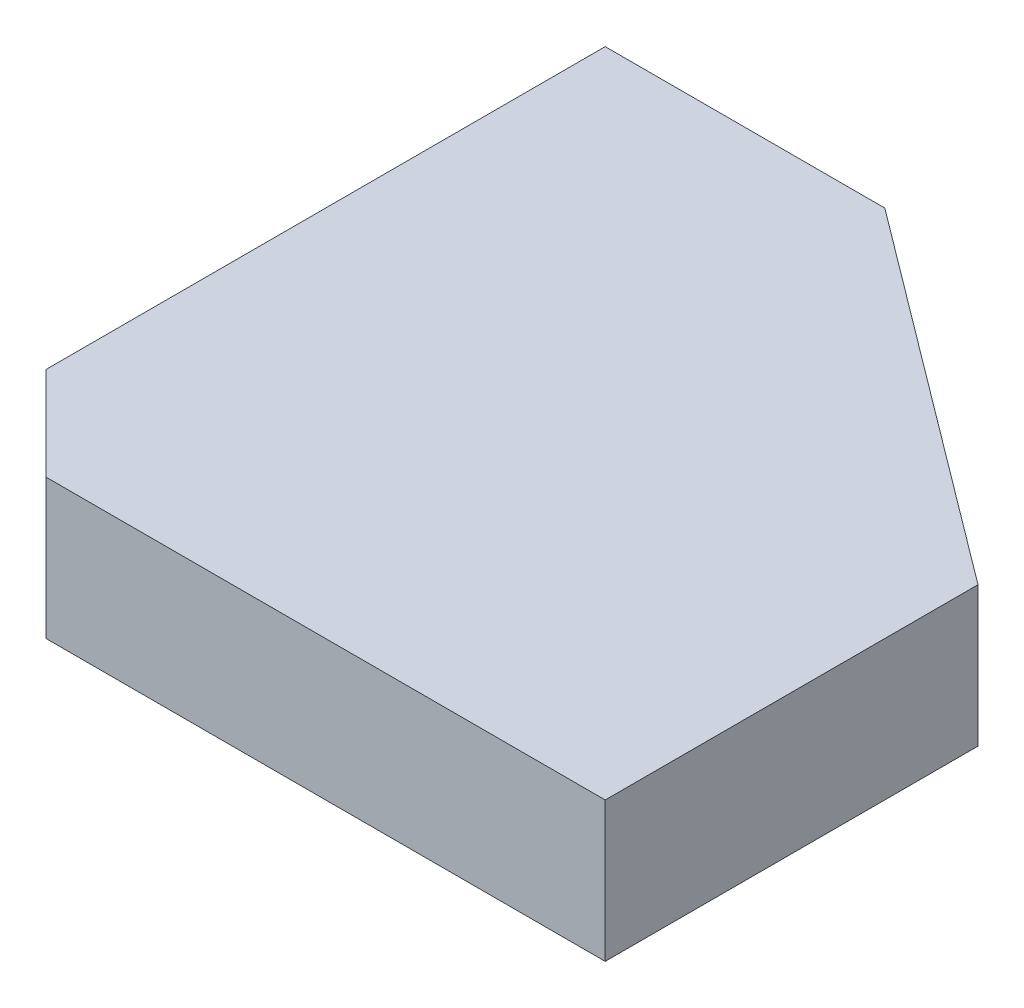
ISO-10303-21;
HEADER;
FILE_DESCRIPTION(('STEP AP214'),'2;1');
FILE_NAME('part.step','',(''),(''),'','','');
FILE_SCHEMA(('AUTOMOTIVE_DESIGN { 1 0 10303 214 1 1 1 1 }'));
ENDSEC;
DATA;
#1=APPLICATION_CONTEXT('core data for automotive mechanical design processes');
#2=APPLICATION_PROTOCOL_DEFINITION('international standard','automotive_design',2000,#1);
#3=PRODUCT_CONTEXT('',#1,'mechanical');
#4=PRODUCT('Part','Part','',(#3));
#5=PRODUCT_RELATED_PRODUCT_CATEGORY('part','',(#4));
#6=PRODUCT_DEFINITION_FORMATION('','',#4);
#7=PRODUCT_DEFINITION_CONTEXT('part definition',#1,'design');
#8=PRODUCT_DEFINITION('design','',#6,#7);
#9=PRODUCT_DEFINITION_SHAPE('','',#8);
#10=(LENGTH_UNIT() NAMED_UNIT(*) SI_UNIT(.MILLI.,.METRE.));
#11=(NAMED_UNIT(*) PLANE_ANGLE_UNIT() SI_UNIT($,.RADIAN.));
#12=(NAMED_UNIT(*) SI_UNIT($,.STERADIAN.) SOLID_ANGLE_UNIT());
#13=UNCERTAINTY_MEASURE_WITH_UNIT(LENGTH_MEASURE(1.E-05),#10,'distance_accuracy_value','');
#14=(GEOMETRIC_REPRESENTATION_CONTEXT(3) GLOBAL_UNCERTAINTY_ASSIGNED_CONTEXT((#13)) GLOBAL_UNIT_ASSIGNED_CONTEXT((#10,
#11,#12)) REPRESENTATION_CONTEXT('',''));
#15=CARTESIAN_POINT('',(0.,0.,0.));
#16=DIRECTION('',(0.,0.,1.));
#17=DIRECTION('',(1.,0.,0.));
#18=AXIS2_PLACEMENT_3D('',#15,#16,#17);
#19=CARTESIAN_POINT('',(0.,4.7625,0.));
#20=DIRECTION('',(-1.,0.,0.));
#21=DIRECTION('',(0.,0.,1.));
#22=AXIS2_PLACEMENT_3D('',#19,#20,#21);
#23=PLANE('',#22);
#24=DIRECTION('',(0.,0.,-1.));
#25=VECTOR('',#24,1.);
#26=CARTESIAN_POINT('',(0.,-4.7625,0.));
#27=LINE('',#26,#25);
#28=CARTESIAN_POINT('',(0.,-4.7625,-6.35000000000004));
#29=VERTEX_POINT('',#28);
#30=CARTESIAN_POINT('',(0.,-4.7625,-44.45));
#31=VERTEX_POINT('',#30);
#32=EDGE_CURVE('E137',#29,#31,#27,.T.);
#33=ORIENTED_EDGE('',*,*,#32,.F.);
#34=DIRECTION('',(0.,1.,0.));
#35=VECTOR('',#34,1.);
#36=CARTESIAN_POINT('',(0.,4.7625,-6.35000000000004));
#37=LINE('',#36,#35);
#38=CARTESIAN_POINT('',(0.,4.7625,-6.35000000000004));
#39=VERTEX_POINT('',#38);
#40=EDGE_CURVE('E42',#29,#39,#37,.T.);
#41=ORIENTED_EDGE('',*,*,#40,.T.);
#42=DIRECTION('',(0.,0.,-1.));
#43=VECTOR('',#42,1.);
#44=CARTESIAN_POINT('',(0.,4.7625,0.));
#45=LINE('',#44,#43);
#46=CARTESIAN_POINT('',(0.,4.7625,-44.45));
#47=VERTEX_POINT('',#46);
#48=EDGE_CURVE('E83',#39,#47,#45,.T.);
#49=ORIENTED_EDGE('',*,*,#48,.T.);
#50=DIRECTION('',(0.,-1.,0.));
#51=VECTOR('',#50,1.);
#52=CARTESIAN_POINT('',(0.,4.7625,-44.45));
#53=LINE('',#52,#51);
#54=EDGE_CURVE('E86',#47,#31,#53,.T.);
#55=ORIENTED_EDGE('',*,*,#54,.T.);
#56=EDGE_LOOP('',(#33,#41,#49,#55));
#57=FACE_BOUND('',#56,.T.);
#58=ADVANCED_FACE('F34',(#57),#23,.T.);
#59=CARTESIAN_POINT('',(0.,4.7625,0.));
#60=DIRECTION('',(0.,0.,-1.));
#61=DIRECTION('',(-1.,0.,0.));
#62=AXIS2_PLACEMENT_3D('',#59,#60,#61);
#63=PLANE('',#62);
#64=DIRECTION('',(1.,0.,0.));
#65=VECTOR('',#64,1.);
#66=CARTESIAN_POINT('',(0.,4.7625,0.));
#67=LINE('',#66,#65);
#68=CARTESIAN_POINT('',(6.35000000000011,4.7625,0.));
#69=VERTEX_POINT('',#68);
#70=CARTESIAN_POINT('',(44.45,4.7625,0.));
#71=VERTEX_POINT('',#70);
#72=EDGE_CURVE('E106',#69,#71,#67,.T.);
#73=ORIENTED_EDGE('',*,*,#72,.F.);
#74=DIRECTION('',(0.,-1.,0.));
#75=VECTOR('',#74,1.);
#76=CARTESIAN_POINT('',(6.35000000000011,-4.7625,0.));
#77=LINE('',#76,#75);
#78=CARTESIAN_POINT('',(6.35000000000011,-4.7625,0.));
#79=VERTEX_POINT('',#78);
#80=EDGE_CURVE('E114',#69,#79,#77,.T.);
#81=ORIENTED_EDGE('',*,*,#80,.T.);
#82=DIRECTION('',(1.,0.,0.));
#83=VECTOR('',#82,1.);
#84=CARTESIAN_POINT('',(0.,-4.7625,0.));
#85=LINE('',#84,#83);
#86=CARTESIAN_POINT('',(44.45,-4.7625,0.));
#87=VERTEX_POINT('',#86);
#88=EDGE_CURVE('E92',#79,#87,#85,.T.);
#89=ORIENTED_EDGE('',*,*,#88,.T.);
#90=DIRECTION('',(0.,-1.,0.));
#91=VECTOR('',#90,1.);
#92=CARTESIAN_POINT('',(44.45,4.7625,0.));
#93=LINE('',#92,#91);
#94=EDGE_CURVE('E117',#71,#87,#93,.T.);
#95=ORIENTED_EDGE('',*,*,#94,.F.);
#96=EDGE_LOOP('',(#73,#81,#89,#95));
#97=FACE_BOUND('',#96,.T.);
#98=ADVANCED_FACE('F145',(#97),#63,.F.);
#99=CARTESIAN_POINT('',(44.45,4.7625,-25.4));
#100=DIRECTION('',(1.,0.,0.));
#101=DIRECTION('',(0.,0.,-1.));
#102=AXIS2_PLACEMENT_3D('',#99,#100,#101);
#103=PLANE('',#102);
#104=DIRECTION('',(0.,0.,1.));
#105=VECTOR('',#104,1.);
#106=CARTESIAN_POINT('',(44.45,-4.7625,-25.4));
#107=LINE('',#106,#105);
#108=CARTESIAN_POINT('',(44.45,-4.7625,-25.4));
#109=VERTEX_POINT('',#108);
#110=EDGE_CURVE('E131',#109,#87,#107,.T.);
#111=ORIENTED_EDGE('',*,*,#110,.F.);
#112=DIRECTION('',(0.,-1.,0.));
#113=VECTOR('',#112,1.);
#114=CARTESIAN_POINT('',(44.45,4.7625,-25.4));
#115=LINE('',#114,#113);
#116=CARTESIAN_POINT('',(44.45,4.7625,-25.4));
#117=VERTEX_POINT('',#116);
#118=EDGE_CURVE('E108',#117,#109,#115,.T.);
#119=ORIENTED_EDGE('',*,*,#118,.F.);
#120=DIRECTION('',(0.,0.,1.));
#121=VECTOR('',#120,1.);
#122=CARTESIAN_POINT('',(44.45,4.7625,-25.4));
#123=LINE('',#122,#121);
#124=EDGE_CURVE('E110',#117,#71,#123,.T.);
#125=ORIENTED_EDGE('',*,*,#124,.T.);
#126=ORIENTED_EDGE('',*,*,#94,.T.);
#127=EDGE_LOOP('',(#111,#119,#125,#126));
#128=FACE_BOUND('',#127,.T.);
#129=ADVANCED_FACE('F146',(#128),#103,.T.);
#130=CARTESIAN_POINT('',(19.05,4.7625,-44.45));
#131=DIRECTION('',(0.6,0.,-0.8));
#132=DIRECTION('',(-0.8,0.,-0.6));
#133=AXIS2_PLACEMENT_3D('',#130,#131,#132);
#134=PLANE('',#133);
#135=DIRECTION('',(0.8,0.,0.6));
#136=VECTOR('',#135,1.);
#137=CARTESIAN_POINT('',(19.05,-4.7625,-44.45));
#138=LINE('',#137,#136);
#139=CARTESIAN_POINT('',(19.05,-4.7625,-44.45));
#140=VERTEX_POINT('',#139);
#141=EDGE_CURVE('E133',#140,#109,#138,.T.);
#142=ORIENTED_EDGE('',*,*,#141,.F.);
#143=DIRECTION('',(0.,-1.,0.));
#144=VECTOR('',#143,1.);
#145=CARTESIAN_POINT('',(19.05,4.7625,-44.45));
#146=LINE('',#145,#144);
#147=CARTESIAN_POINT('',(19.05,4.7625,-44.45));
#148=VERTEX_POINT('',#147);
#149=EDGE_CURVE('E105',#148,#140,#146,.T.);
#150=ORIENTED_EDGE('',*,*,#149,.F.);
#151=DIRECTION('',(0.8,0.,0.6));
#152=VECTOR('',#151,1.);
#153=CARTESIAN_POINT('',(19.05,4.7625,-44.45));
#154=LINE('',#153,#152);
#155=EDGE_CURVE('E99',#148,#117,#154,.T.);
#156=ORIENTED_EDGE('',*,*,#155,.T.);
#157=ORIENTED_EDGE('',*,*,#118,.T.);
#158=EDGE_LOOP('',(#142,#150,#156,#157));
#159=FACE_BOUND('',#158,.T.);
#160=ADVANCED_FACE('F142',(#159),#134,.T.);
#161=CARTESIAN_POINT('',(19.05,4.7625,-44.45));
#162=DIRECTION('',(0.,0.,1.));
#163=DIRECTION('',(1.,0.,0.));
#164=AXIS2_PLACEMENT_3D('',#161,#162,#163);
#165=PLANE('',#164);
#166=DIRECTION('',(-1.,0.,0.));
#167=VECTOR('',#166,1.);
#168=CARTESIAN_POINT('',(19.05,-4.7625,-44.45));
#169=LINE('',#168,#167);
#170=EDGE_CURVE('E104',#140,#31,#169,.T.);
#171=ORIENTED_EDGE('',*,*,#170,.T.);
#172=ORIENTED_EDGE('',*,*,#54,.F.);
#173=DIRECTION('',(-1.,0.,0.));
#174=VECTOR('',#173,1.);
#175=CARTESIAN_POINT('',(19.05,4.7625,-44.45));
#176=LINE('',#175,#174);
#177=EDGE_CURVE('E91',#148,#47,#176,.T.);
#178=ORIENTED_EDGE('',*,*,#177,.F.);
#179=ORIENTED_EDGE('',*,*,#149,.T.);
#180=EDGE_LOOP('',(#171,#172,#178,#179));
#181=FACE_BOUND('',#180,.T.);
#182=ADVANCED_FACE('F102',(#181),#165,.F.);
#183=CARTESIAN_POINT('',(0.,4.7625,0.));
#184=DIRECTION('',(0.,-1.,0.));
#185=DIRECTION('',(0.,0.,-1.));
#186=AXIS2_PLACEMENT_3D('',#183,#184,#185);
#187=PLANE('',#186);
#188=ORIENTED_EDGE('',*,*,#48,.F.);
#189=DIRECTION('',(0.707106781186551,0.,0.707106781186544));
#190=VECTOR('',#189,1.);
#191=CARTESIAN_POINT('',(6.35000000000011,4.7625,0.));
#192=LINE('',#191,#190);
#193=EDGE_CURVE('E11',#39,#69,#192,.T.);
#194=ORIENTED_EDGE('',*,*,#193,.T.);
#195=ORIENTED_EDGE('',*,*,#72,.T.);
#196=ORIENTED_EDGE('',*,*,#124,.F.);
#197=ORIENTED_EDGE('',*,*,#155,.F.);
#198=ORIENTED_EDGE('',*,*,#177,.T.);
#199=EDGE_LOOP('',(#188,#194,#195,#196,#197,#198));
#200=FACE_BOUND('',#199,.T.);
#201=ADVANCED_FACE('F96',(#200),#187,.F.);
#202=CARTESIAN_POINT('',(0.,-4.7625,0.));
#203=DIRECTION('',(0.,-1.,0.));
#204=DIRECTION('',(0.,0.,-1.));
#205=AXIS2_PLACEMENT_3D('',#202,#203,#204);
#206=PLANE('',#205);
#207=ORIENTED_EDGE('',*,*,#88,.F.);
#208=DIRECTION('',(-0.707106781186551,0.,-0.707106781186544));
#209=VECTOR('',#208,1.);
#210=CARTESIAN_POINT('',(3.17500000000002,-4.7625,-3.17500000000005));
#211=LINE('',#210,#209);
#212=EDGE_CURVE('E56',#79,#29,#211,.T.);
#213=ORIENTED_EDGE('',*,*,#212,.T.);
#214=ORIENTED_EDGE('',*,*,#32,.T.);
#215=ORIENTED_EDGE('',*,*,#170,.F.);
#216=ORIENTED_EDGE('',*,*,#141,.T.);
#217=ORIENTED_EDGE('',*,*,#110,.T.);
#218=EDGE_LOOP('',(#207,#213,#214,#215,#216,#217));
#219=FACE_BOUND('',#218,.T.);
#220=ADVANCED_FACE('F143',(#219),#206,.T.);
#221=CARTESIAN_POINT('',(6.35000000000011,4.7625,0.));
#222=DIRECTION('',(-0.707106781186544,0.,0.707106781186551));
#223=DIRECTION('',(0.707106781186551,0.,0.707106781186544));
#224=AXIS2_PLACEMENT_3D('',#221,#222,#223);
#225=PLANE('',#224);
#226=ORIENTED_EDGE('',*,*,#193,.F.);
#227=ORIENTED_EDGE('',*,*,#40,.F.);
#228=ORIENTED_EDGE('',*,*,#212,.F.);
#229=ORIENTED_EDGE('',*,*,#80,.F.);
#230=EDGE_LOOP('',(#226,#227,#228,#229));
#231=FACE_BOUND('',#230,.T.);
#232=ADVANCED_FACE('F36',(#231),#225,.T.);
#233=CLOSED_SHELL('',(#58,#98,#129,#160,#182,#201,#220,#232));
#234=MANIFOLD_SOLID_BREP('B2',#233);
#235=ADVANCED_BREP_SHAPE_REPRESENTATION('',(#18,#234),#14);
#236=SHAPE_DEFINITION_REPRESENTATION(#9,#235);
ENDSEC;
END-ISO-10303-21;
